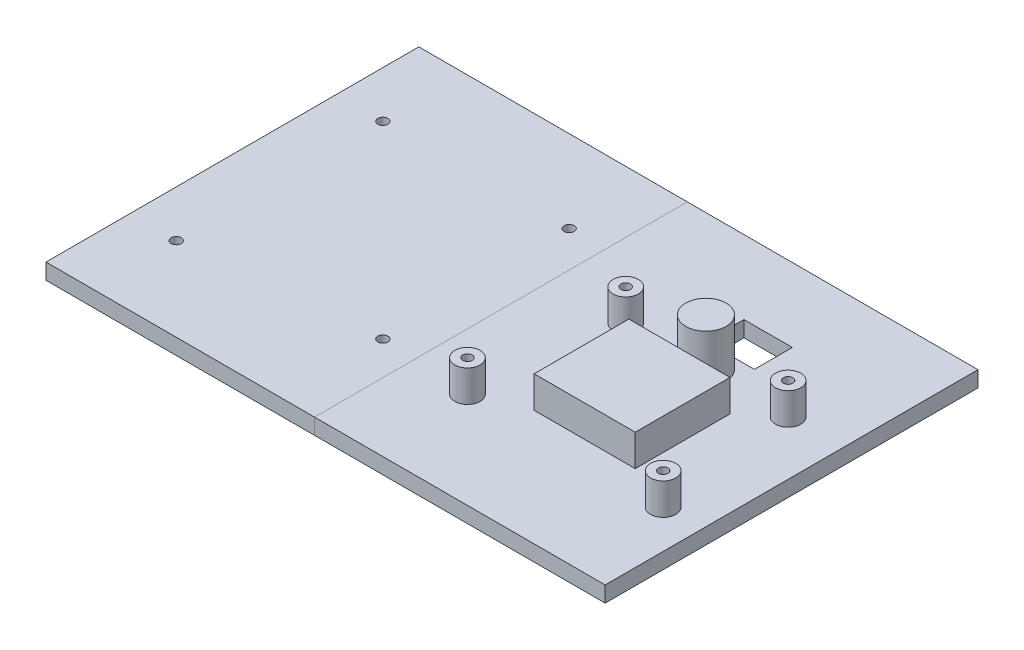
ISO-10303-21;
HEADER;
FILE_DESCRIPTION(('STEP AP214'),'2;1');
FILE_NAME('part.step','',(''),(''),'','','');
FILE_SCHEMA(('AUTOMOTIVE_DESIGN { 1 0 10303 214 1 1 1 1 }'));
ENDSEC;
DATA;
#1=APPLICATION_CONTEXT('core data for automotive mechanical design processes');
#2=APPLICATION_PROTOCOL_DEFINITION('international standard','automotive_design',2000,#1);
#3=PRODUCT_CONTEXT('',#1,'mechanical');
#4=PRODUCT('Part','Part','',(#3));
#5=PRODUCT_RELATED_PRODUCT_CATEGORY('part','',(#4));
#6=PRODUCT_DEFINITION_FORMATION('','',#4);
#7=PRODUCT_DEFINITION_CONTEXT('part definition',#1,'design');
#8=PRODUCT_DEFINITION('design','',#6,#7);
#9=PRODUCT_DEFINITION_SHAPE('','',#8);
#10=(LENGTH_UNIT() NAMED_UNIT(*) SI_UNIT(.MILLI.,.METRE.));
#11=(NAMED_UNIT(*) PLANE_ANGLE_UNIT() SI_UNIT($,.RADIAN.));
#12=(NAMED_UNIT(*) SI_UNIT($,.STERADIAN.) SOLID_ANGLE_UNIT());
#13=UNCERTAINTY_MEASURE_WITH_UNIT(LENGTH_MEASURE(1.E-05),#10,'distance_accuracy_value','');
#14=(GEOMETRIC_REPRESENTATION_CONTEXT(3) GLOBAL_UNCERTAINTY_ASSIGNED_CONTEXT((#13)) GLOBAL_UNIT_ASSIGNED_CONTEXT((#10,
#11,#12)) REPRESENTATION_CONTEXT('',''));
#15=CARTESIAN_POINT('',(0.,0.,0.));
#16=DIRECTION('',(0.,0.,1.));
#17=DIRECTION('',(1.,0.,0.));
#18=AXIS2_PLACEMENT_3D('',#15,#16,#17);
#19=CARTESIAN_POINT('',(-48.875,0.,0.));
#20=DIRECTION('',(1.,0.,0.));
#21=DIRECTION('',(0.,0.,-1.));
#22=AXIS2_PLACEMENT_3D('',#19,#20,#21);
#23=PLANE('',#22);
#24=DIRECTION('',(0.,-1.,0.));
#25=VECTOR('',#24,1.);
#26=CARTESIAN_POINT('',(-48.875,5.,-55.5));
#27=LINE('',#26,#25);
#28=CARTESIAN_POINT('',(-48.875,5.,-55.5));
#29=VERTEX_POINT('',#28);
#30=CARTESIAN_POINT('',(-48.875,0.,-55.5));
#31=VERTEX_POINT('',#30);
#32=EDGE_CURVE('E82',#29,#31,#27,.T.);
#33=ORIENTED_EDGE('',*,*,#32,.F.);
#34=DIRECTION('',(0.,0.,-1.));
#35=VECTOR('',#34,1.);
#36=CARTESIAN_POINT('',(-48.875,5.,0.));
#37=LINE('',#36,#35);
#38=CARTESIAN_POINT('',(-48.875,5.,62.5));
#39=VERTEX_POINT('',#38);
#40=EDGE_CURVE('E102',#39,#29,#37,.T.);
#41=ORIENTED_EDGE('',*,*,#40,.F.);
#42=DIRECTION('',(0.,-1.,0.));
#43=VECTOR('',#42,1.);
#44=CARTESIAN_POINT('',(-48.875,5.,62.5));
#45=LINE('',#44,#43);
#46=CARTESIAN_POINT('',(-48.875,0.,62.5));
#47=VERTEX_POINT('',#46);
#48=EDGE_CURVE('E94',#39,#47,#45,.T.);
#49=ORIENTED_EDGE('',*,*,#48,.T.);
#50=DIRECTION('',(0.,0.,-1.));
#51=VECTOR('',#50,1.);
#52=CARTESIAN_POINT('',(-48.875,0.,0.));
#53=LINE('',#52,#51);
#54=EDGE_CURVE('E99',#47,#31,#53,.T.);
#55=ORIENTED_EDGE('',*,*,#54,.T.);
#56=EDGE_LOOP('',(#33,#41,#49,#55));
#57=FACE_BOUND('',#56,.T.);
#58=ADVANCED_FACE('F45',(#57),#23,.T.);
#59=CARTESIAN_POINT('',(0.,5.,0.));
#60=DIRECTION('',(0.,1.,0.));
#61=DIRECTION('',(0.,0.,1.));
#62=AXIS2_PLACEMENT_3D('',#59,#60,#61);
#63=PLANE('',#62);
#64=CARTESIAN_POINT('',(-119.139988314674,5.,36.013));
#65=DIRECTION('',(0.,1.,0.));
#66=DIRECTION('',(0.,0.,1.));
#67=AXIS2_PLACEMENT_3D('',#64,#65,#66);
#68=CIRCLE('',#67,1.59999999999999);
#69=CARTESIAN_POINT('',(-119.139988314674,5.,37.613));
#70=VERTEX_POINT('',#69);
#71=EDGE_CURVE('E242',#70,#70,#68,.T.);
#72=ORIENTED_EDGE('',*,*,#71,.F.);
#73=EDGE_LOOP('',(#72));
#74=FACE_BOUND('',#73,.T.);
#75=CARTESIAN_POINT('',(-119.139988314674,5.,-29.392));
#76=DIRECTION('',(0.,1.,0.));
#77=DIRECTION('',(0.,0.,1.));
#78=AXIS2_PLACEMENT_3D('',#75,#76,#77);
#79=CIRCLE('',#78,1.6);
#80=CARTESIAN_POINT('',(-119.139988314674,5.,-27.792));
#81=VERTEX_POINT('',#80);
#82=EDGE_CURVE('E229',#81,#81,#79,.T.);
#83=ORIENTED_EDGE('',*,*,#82,.F.);
#84=EDGE_LOOP('',(#83));
#85=FACE_BOUND('',#84,.T.);
#86=CARTESIAN_POINT('',(-60.2619883146741,5.,-29.4860000000002));
#87=DIRECTION('',(0.,1.,0.));
#88=DIRECTION('',(0.,0.,1.));
#89=AXIS2_PLACEMENT_3D('',#86,#87,#88);
#90=CIRCLE('',#89,1.6);
#91=CARTESIAN_POINT('',(-60.2619883146741,5.,-27.8860000000002));
#92=VERTEX_POINT('',#91);
#93=EDGE_CURVE('E245',#92,#92,#90,.T.);
#94=ORIENTED_EDGE('',*,*,#93,.F.);
#95=EDGE_LOOP('',(#94));
#96=FACE_BOUND('',#95,.T.);
#97=CARTESIAN_POINT('',(-59.4499883146739,5.,30.2979999999998));
#98=DIRECTION('',(0.,1.,0.));
#99=DIRECTION('',(0.,0.,1.));
#100=AXIS2_PLACEMENT_3D('',#97,#98,#99);
#101=CIRCLE('',#100,1.6);
#102=CARTESIAN_POINT('',(-59.4499883146739,5.,31.8979999999998));
#103=VERTEX_POINT('',#102);
#104=EDGE_CURVE('E111',#103,#103,#101,.T.);
#105=ORIENTED_EDGE('',*,*,#104,.F.);
#106=EDGE_LOOP('',(#105));
#107=FACE_BOUND('',#106,.T.);
#108=DIRECTION('',(1.,0.,0.));
#109=VECTOR('',#108,1.);
#110=CARTESIAN_POINT('',(0.,5.,62.5));
#111=LINE('',#110,#109);
#112=CARTESIAN_POINT('',(-133.875,5.,62.5));
#113=VERTEX_POINT('',#112);
#114=EDGE_CURVE('E74',#113,#39,#111,.T.);
#115=ORIENTED_EDGE('',*,*,#114,.T.);
#116=ORIENTED_EDGE('',*,*,#40,.T.);
#117=DIRECTION('',(1.,0.,0.));
#118=VECTOR('',#117,1.);
#119=CARTESIAN_POINT('',(0.,5.,-55.5));
#120=LINE('',#119,#118);
#121=CARTESIAN_POINT('',(-133.875,5.,-55.5));
#122=VERTEX_POINT('',#121);
#123=EDGE_CURVE('E112',#122,#29,#120,.T.);
#124=ORIENTED_EDGE('',*,*,#123,.F.);
#125=DIRECTION('',(0.,0.,1.));
#126=VECTOR('',#125,1.);
#127=CARTESIAN_POINT('',(-133.875,5.,0.));
#128=LINE('',#127,#126);
#129=EDGE_CURVE('E110',#122,#113,#128,.T.);
#130=ORIENTED_EDGE('',*,*,#129,.T.);
#131=EDGE_LOOP('',(#115,#116,#124,#130));
#132=FACE_BOUND('',#131,.T.);
#133=ADVANCED_FACE('F123',(#74,#85,#96,#107,#132),#63,.T.);
#134=CARTESIAN_POINT('',(0.,0.,0.));
#135=DIRECTION('',(0.,1.,0.));
#136=DIRECTION('',(0.,0.,1.));
#137=AXIS2_PLACEMENT_3D('',#134,#135,#136);
#138=PLANE('',#137);
#139=CARTESIAN_POINT('',(-59.4499883146739,0.,30.2979999999998));
#140=DIRECTION('',(0.,1.,0.));
#141=DIRECTION('',(0.,0.,1.));
#142=AXIS2_PLACEMENT_3D('',#139,#140,#141);
#143=CIRCLE('',#142,1.6);
#144=CARTESIAN_POINT('',(-59.4499883146739,0.,31.8979999999998));
#145=VERTEX_POINT('',#144);
#146=EDGE_CURVE('E98',#145,#145,#143,.T.);
#147=ORIENTED_EDGE('',*,*,#146,.T.);
#148=EDGE_LOOP('',(#147));
#149=FACE_BOUND('',#148,.T.);
#150=CARTESIAN_POINT('',(-60.2619883146741,0.,-29.4860000000002));
#151=DIRECTION('',(0.,1.,0.));
#152=DIRECTION('',(0.,0.,1.));
#153=AXIS2_PLACEMENT_3D('',#150,#151,#152);
#154=CIRCLE('',#153,1.6);
#155=CARTESIAN_POINT('',(-60.2619883146741,0.,-27.8860000000002));
#156=VERTEX_POINT('',#155);
#157=EDGE_CURVE('E233',#156,#156,#154,.T.);
#158=ORIENTED_EDGE('',*,*,#157,.T.);
#159=EDGE_LOOP('',(#158));
#160=FACE_BOUND('',#159,.T.);
#161=CARTESIAN_POINT('',(-119.139988314674,0.,-29.392));
#162=DIRECTION('',(0.,1.,0.));
#163=DIRECTION('',(0.,0.,1.));
#164=AXIS2_PLACEMENT_3D('',#161,#162,#163);
#165=CIRCLE('',#164,1.6);
#166=CARTESIAN_POINT('',(-119.139988314674,0.,-27.792));
#167=VERTEX_POINT('',#166);
#168=EDGE_CURVE('E116',#167,#167,#165,.T.);
#169=ORIENTED_EDGE('',*,*,#168,.T.);
#170=EDGE_LOOP('',(#169));
#171=FACE_BOUND('',#170,.T.);
#172=CARTESIAN_POINT('',(-119.139988314674,0.,36.013));
#173=DIRECTION('',(0.,1.,0.));
#174=DIRECTION('',(0.,0.,1.));
#175=AXIS2_PLACEMENT_3D('',#172,#173,#174);
#176=CIRCLE('',#175,1.59999999999999);
#177=CARTESIAN_POINT('',(-119.139988314674,0.,37.613));
#178=VERTEX_POINT('',#177);
#179=EDGE_CURVE('E113',#178,#178,#176,.T.);
#180=ORIENTED_EDGE('',*,*,#179,.T.);
#181=EDGE_LOOP('',(#180));
#182=FACE_BOUND('',#181,.T.);
#183=ORIENTED_EDGE('',*,*,#54,.F.);
#184=DIRECTION('',(1.,0.,0.));
#185=VECTOR('',#184,1.);
#186=CARTESIAN_POINT('',(0.,0.,62.5));
#187=LINE('',#186,#185);
#188=CARTESIAN_POINT('',(-133.875,0.,62.5));
#189=VERTEX_POINT('',#188);
#190=EDGE_CURVE('E90',#189,#47,#187,.T.);
#191=ORIENTED_EDGE('',*,*,#190,.F.);
#192=DIRECTION('',(0.,0.,1.));
#193=VECTOR('',#192,1.);
#194=CARTESIAN_POINT('',(-133.875,0.,0.));
#195=LINE('',#194,#193);
#196=CARTESIAN_POINT('',(-133.875,0.,-55.5));
#197=VERTEX_POINT('',#196);
#198=EDGE_CURVE('E54',#197,#189,#195,.T.);
#199=ORIENTED_EDGE('',*,*,#198,.F.);
#200=DIRECTION('',(1.,0.,0.));
#201=VECTOR('',#200,1.);
#202=CARTESIAN_POINT('',(0.,0.,-55.5));
#203=LINE('',#202,#201);
#204=EDGE_CURVE('E12',#197,#31,#203,.T.);
#205=ORIENTED_EDGE('',*,*,#204,.T.);
#206=EDGE_LOOP('',(#183,#191,#199,#205));
#207=FACE_BOUND('',#206,.T.);
#208=ADVANCED_FACE('F100',(#149,#160,#171,#182,#207),#138,.F.);
#209=CARTESIAN_POINT('',(0.,5.,-55.5));
#210=DIRECTION('',(0.,0.,-1.));
#211=DIRECTION('',(-1.,0.,0.));
#212=AXIS2_PLACEMENT_3D('',#209,#210,#211);
#213=PLANE('',#212);
#214=ORIENTED_EDGE('',*,*,#123,.T.);
#215=ORIENTED_EDGE('',*,*,#32,.T.);
#216=ORIENTED_EDGE('',*,*,#204,.F.);
#217=DIRECTION('',(0.,-1.,0.));
#218=VECTOR('',#217,1.);
#219=CARTESIAN_POINT('',(-133.875,5.,-55.5));
#220=LINE('',#219,#218);
#221=EDGE_CURVE('E62',#122,#197,#220,.T.);
#222=ORIENTED_EDGE('',*,*,#221,.F.);
#223=EDGE_LOOP('',(#214,#215,#216,#222));
#224=FACE_BOUND('',#223,.T.);
#225=ADVANCED_FACE('F47',(#224),#213,.T.);
#226=CARTESIAN_POINT('',(0.,5.,62.5));
#227=DIRECTION('',(0.,0.,-1.));
#228=DIRECTION('',(-1.,0.,0.));
#229=AXIS2_PLACEMENT_3D('',#226,#227,#228);
#230=PLANE('',#229);
#231=ORIENTED_EDGE('',*,*,#48,.F.);
#232=ORIENTED_EDGE('',*,*,#114,.F.);
#233=DIRECTION('',(0.,-1.,0.));
#234=VECTOR('',#233,1.);
#235=CARTESIAN_POINT('',(-133.875,5.,62.5));
#236=LINE('',#235,#234);
#237=EDGE_CURVE('E96',#113,#189,#236,.T.);
#238=ORIENTED_EDGE('',*,*,#237,.T.);
#239=ORIENTED_EDGE('',*,*,#190,.T.);
#240=EDGE_LOOP('',(#231,#232,#238,#239));
#241=FACE_BOUND('',#240,.T.);
#242=ADVANCED_FACE('F92',(#241),#230,.F.);
#243=CARTESIAN_POINT('',(-133.875,5.,0.));
#244=DIRECTION('',(1.,0.,0.));
#245=DIRECTION('',(0.,0.,-1.));
#246=AXIS2_PLACEMENT_3D('',#243,#244,#245);
#247=PLANE('',#246);
#248=ORIENTED_EDGE('',*,*,#198,.T.);
#249=ORIENTED_EDGE('',*,*,#237,.F.);
#250=ORIENTED_EDGE('',*,*,#129,.F.);
#251=ORIENTED_EDGE('',*,*,#221,.T.);
#252=EDGE_LOOP('',(#248,#249,#250,#251));
#253=FACE_BOUND('',#252,.T.);
#254=ADVANCED_FACE('F138',(#253),#247,.F.);
#255=CARTESIAN_POINT('',(-119.139988314674,5.,-29.392));
#256=DIRECTION('',(0.,-1.,0.));
#257=DIRECTION('',(0.,0.,-1.));
#258=AXIS2_PLACEMENT_3D('',#255,#256,#257);
#259=CYLINDRICAL_SURFACE('',#258,1.6);
#260=ORIENTED_EDGE('',*,*,#82,.T.);
#261=EDGE_LOOP('',(#260));
#262=FACE_BOUND('',#261,.T.);
#263=ORIENTED_EDGE('',*,*,#168,.F.);
#264=EDGE_LOOP('',(#263));
#265=FACE_BOUND('',#264,.T.);
#266=ADVANCED_FACE('F143',(#262,#265),#259,.F.);
#267=CARTESIAN_POINT('',(-60.2619883146741,5.,-29.4860000000002));
#268=DIRECTION('',(0.,-1.,0.));
#269=DIRECTION('',(0.,0.,-1.));
#270=AXIS2_PLACEMENT_3D('',#267,#268,#269);
#271=CYLINDRICAL_SURFACE('',#270,1.6);
#272=ORIENTED_EDGE('',*,*,#93,.T.);
#273=EDGE_LOOP('',(#272));
#274=FACE_BOUND('',#273,.T.);
#275=ORIENTED_EDGE('',*,*,#157,.F.);
#276=EDGE_LOOP('',(#275));
#277=FACE_BOUND('',#276,.T.);
#278=ADVANCED_FACE('F183',(#274,#277),#271,.F.);
#279=CARTESIAN_POINT('',(-59.4499883146739,5.,30.2979999999998));
#280=DIRECTION('',(0.,-1.,0.));
#281=DIRECTION('',(0.,0.,-1.));
#282=AXIS2_PLACEMENT_3D('',#279,#280,#281);
#283=CYLINDRICAL_SURFACE('',#282,1.6);
#284=ORIENTED_EDGE('',*,*,#104,.T.);
#285=EDGE_LOOP('',(#284));
#286=FACE_BOUND('',#285,.T.);
#287=ORIENTED_EDGE('',*,*,#146,.F.);
#288=EDGE_LOOP('',(#287));
#289=FACE_BOUND('',#288,.T.);
#290=ADVANCED_FACE('F174',(#286,#289),#283,.F.);
#291=CARTESIAN_POINT('',(-119.139988314674,5.,36.013));
#292=DIRECTION('',(0.,-1.,0.));
#293=DIRECTION('',(0.,0.,-1.));
#294=AXIS2_PLACEMENT_3D('',#291,#292,#293);
#295=CYLINDRICAL_SURFACE('',#294,1.59999999999999);
#296=ORIENTED_EDGE('',*,*,#71,.T.);
#297=EDGE_LOOP('',(#296));
#298=FACE_BOUND('',#297,.T.);
#299=ORIENTED_EDGE('',*,*,#179,.F.);
#300=EDGE_LOOP('',(#299));
#301=FACE_BOUND('',#300,.T.);
#302=ADVANCED_FACE('F134',(#298,#301),#295,.F.);
#303=CLOSED_SHELL('',(#58,#133,#208,#225,#242,#254,#266,#278,#290,#302));
#304=MANIFOLD_SOLID_BREP('B2',#303);
#305=CARTESIAN_POINT('',(-48.875,0.,0.));
#306=DIRECTION('',(1.,0.,0.));
#307=DIRECTION('',(0.,0.,-1.));
#308=AXIS2_PLACEMENT_3D('',#305,#306,#307);
#309=PLANE('',#308);
#310=DIRECTION('',(0.,-1.,0.));
#311=VECTOR('',#310,1.);
#312=CARTESIAN_POINT('',(-48.875,5.,-55.5));
#313=LINE('',#312,#311);
#314=CARTESIAN_POINT('',(-48.875,5.,-55.5));
#315=VERTEX_POINT('',#314);
#316=CARTESIAN_POINT('',(-48.875,0.,-55.5));
#317=VERTEX_POINT('',#316);
#318=EDGE_CURVE('E43',#315,#317,#313,.T.);
#319=ORIENTED_EDGE('',*,*,#318,.T.);
#320=DIRECTION('',(0.,0.,-1.));
#321=VECTOR('',#320,1.);
#322=CARTESIAN_POINT('',(-48.875,0.,0.));
#323=LINE('',#322,#321);
#324=CARTESIAN_POINT('',(-48.875,0.,62.5));
#325=VERTEX_POINT('',#324);
#326=EDGE_CURVE('E282',#325,#317,#323,.T.);
#327=ORIENTED_EDGE('',*,*,#326,.F.);
#328=DIRECTION('',(0.,-1.,0.));
#329=VECTOR('',#328,1.);
#330=CARTESIAN_POINT('',(-48.875,5.,62.5));
#331=LINE('',#330,#329);
#332=CARTESIAN_POINT('',(-48.875,5.,62.5));
#333=VERTEX_POINT('',#332);
#334=EDGE_CURVE('E452',#333,#325,#331,.T.);
#335=ORIENTED_EDGE('',*,*,#334,.F.);
#336=DIRECTION('',(0.,0.,-1.));
#337=VECTOR('',#336,1.);
#338=CARTESIAN_POINT('',(-48.875,5.,0.));
#339=LINE('',#338,#337);
#340=EDGE_CURVE('E275',#333,#315,#339,.T.);
#341=ORIENTED_EDGE('',*,*,#340,.T.);
#342=EDGE_LOOP('',(#319,#327,#335,#341));
#343=FACE_BOUND('',#342,.T.);
#344=ADVANCED_FACE('F268',(#343),#309,.F.);
#345=CARTESIAN_POINT('',(0.,20.,-12.51));
#346=DIRECTION('',(0.,1.,0.));
#347=DIRECTION('',(0.,0.,1.));
#348=AXIS2_PLACEMENT_3D('',#345,#346,#347);
#349=PLANE('',#348);
#350=CARTESIAN_POINT('',(0.,20.,-12.51));
#351=DIRECTION('',(0.,1.,0.));
#352=DIRECTION('',(0.,0.,1.));
#353=AXIS2_PLACEMENT_3D('',#350,#351,#352);
#354=CIRCLE('',#353,6.39);
#355=CARTESIAN_POINT('',(0.,20.,-6.12000000000001));
#356=VERTEX_POINT('',#355);
#357=EDGE_CURVE('E563',#356,#356,#354,.T.);
#358=ORIENTED_EDGE('',*,*,#357,.T.);
#359=EDGE_LOOP('',(#358));
#360=FACE_BOUND('',#359,.T.);
#361=ADVANCED_FACE('F480',(#360),#349,.T.);
#362=CARTESIAN_POINT('',(0.,15.,0.));
#363=DIRECTION('',(0.,1.,0.));
#364=DIRECTION('',(0.,0.,1.));
#365=AXIS2_PLACEMENT_3D('',#362,#363,#364);
#366=PLANE('',#365);
#367=DIRECTION('',(1.,0.,0.));
#368=VECTOR('',#367,1.);
#369=CARTESIAN_POINT('',(0.,15.,25.88));
#370=LINE('',#369,#368);
#371=CARTESIAN_POINT('',(-16.,15.,25.88));
#372=VERTEX_POINT('',#371);
#373=CARTESIAN_POINT('',(16.,15.,25.88));
#374=VERTEX_POINT('',#373);
#375=EDGE_CURVE('E368',#372,#374,#370,.T.);
#376=ORIENTED_EDGE('',*,*,#375,.T.);
#377=DIRECTION('',(0.,0.,-1.));
#378=VECTOR('',#377,1.);
#379=CARTESIAN_POINT('',(16.,15.,0.));
#380=LINE('',#379,#378);
#381=CARTESIAN_POINT('',(16.,15.,-4.12000000000001));
#382=VERTEX_POINT('',#381);
#383=EDGE_CURVE('E355',#374,#382,#380,.T.);
#384=ORIENTED_EDGE('',*,*,#383,.T.);
#385=DIRECTION('',(1.,0.,0.));
#386=VECTOR('',#385,1.);
#387=CARTESIAN_POINT('',(0.,15.,-4.12000000000001));
#388=LINE('',#387,#386);
#389=CARTESIAN_POINT('',(-16.,15.,-4.12000000000001));
#390=VERTEX_POINT('',#389);
#391=EDGE_CURVE('E367',#390,#382,#388,.T.);
#392=ORIENTED_EDGE('',*,*,#391,.F.);
#393=DIRECTION('',(0.,0.,-1.));
#394=VECTOR('',#393,1.);
#395=CARTESIAN_POINT('',(-16.,15.,0.));
#396=LINE('',#395,#394);
#397=EDGE_CURVE('E374',#372,#390,#396,.T.);
#398=ORIENTED_EDGE('',*,*,#397,.F.);
#399=EDGE_LOOP('',(#376,#384,#392,#398));
#400=FACE_BOUND('',#399,.T.);
#401=ADVANCED_FACE('F372',(#400),#366,.T.);
#402=CARTESIAN_POINT('',(0.,15.,0.));
#403=DIRECTION('',(0.,1.,0.));
#404=DIRECTION('',(0.,0.,1.));
#405=AXIS2_PLACEMENT_3D('',#402,#403,#404);
#406=PLANE('',#405);
#407=CARTESIAN_POINT('',(30.975,15.,32.));
#408=DIRECTION('',(0.,1.,0.));
#409=DIRECTION('',(0.,0.,1.));
#410=AXIS2_PLACEMENT_3D('',#407,#408,#409);
#411=CIRCLE('',#410,1.50000000000001);
#412=CARTESIAN_POINT('',(30.975,15.,33.5));
#413=VERTEX_POINT('',#412);
#414=EDGE_CURVE('E611',#413,#413,#411,.F.);
#415=ORIENTED_EDGE('',*,*,#414,.T.);
#416=EDGE_LOOP('',(#415));
#417=FACE_BOUND('',#416,.T.);
#418=CARTESIAN_POINT('',(30.975,15.,32.));
#419=DIRECTION('',(0.,1.,0.));
#420=DIRECTION('',(0.,0.,1.));
#421=AXIS2_PLACEMENT_3D('',#418,#419,#420);
#422=CIRCLE('',#421,4.);
#423=CARTESIAN_POINT('',(30.975,15.,36.));
#424=VERTEX_POINT('',#423);
#425=EDGE_CURVE('E614',#424,#424,#422,.T.);
#426=ORIENTED_EDGE('',*,*,#425,.T.);
#427=EDGE_LOOP('',(#426));
#428=FACE_BOUND('',#427,.T.);
#429=ADVANCED_FACE('F489',(#417,#428),#406,.T.);
#430=CARTESIAN_POINT('',(0.,15.,0.));
#431=DIRECTION('',(0.,1.,0.));
#432=DIRECTION('',(0.,0.,1.));
#433=AXIS2_PLACEMENT_3D('',#430,#431,#432);
#434=PLANE('',#433);
#435=CARTESIAN_POINT('',(-25.375,15.,-12.5));
#436=DIRECTION('',(0.,1.,0.));
#437=DIRECTION('',(0.,0.,1.));
#438=AXIS2_PLACEMENT_3D('',#435,#436,#437);
#439=CIRCLE('',#438,1.5);
#440=CARTESIAN_POINT('',(-25.375,15.,-11.));
#441=VERTEX_POINT('',#440);
#442=EDGE_CURVE('E557',#441,#441,#439,.F.);
#443=ORIENTED_EDGE('',*,*,#442,.T.);
#444=EDGE_LOOP('',(#443));
#445=FACE_BOUND('',#444,.T.);
#446=CARTESIAN_POINT('',(-25.375,15.,-12.5));
#447=DIRECTION('',(0.,1.,0.));
#448=DIRECTION('',(0.,0.,1.));
#449=AXIS2_PLACEMENT_3D('',#446,#447,#448);
#450=CIRCLE('',#449,4.);
#451=CARTESIAN_POINT('',(-25.375,15.,-8.5));
#452=VERTEX_POINT('',#451);
#453=EDGE_CURVE('E559',#452,#452,#450,.T.);
#454=ORIENTED_EDGE('',*,*,#453,.T.);
#455=EDGE_LOOP('',(#454));
#456=FACE_BOUND('',#455,.T.);
#457=ADVANCED_FACE('F639',(#445,#456),#434,.T.);
#458=CARTESIAN_POINT('',(0.,15.,0.));
#459=DIRECTION('',(0.,1.,0.));
#460=DIRECTION('',(0.,0.,1.));
#461=AXIS2_PLACEMENT_3D('',#458,#459,#460);
#462=PLANE('',#461);
#463=CARTESIAN_POINT('',(26.025,15.,-12.5));
#464=DIRECTION('',(0.,1.,0.));
#465=DIRECTION('',(0.,0.,1.));
#466=AXIS2_PLACEMENT_3D('',#463,#464,#465);
#467=CIRCLE('',#466,1.5);
#468=CARTESIAN_POINT('',(26.025,15.,-11.));
#469=VERTEX_POINT('',#468);
#470=EDGE_CURVE('E618',#469,#469,#467,.F.);
#471=ORIENTED_EDGE('',*,*,#470,.T.);
#472=EDGE_LOOP('',(#471));
#473=FACE_BOUND('',#472,.T.);
#474=CARTESIAN_POINT('',(26.025,15.,-12.5));
#475=DIRECTION('',(0.,1.,0.));
#476=DIRECTION('',(0.,0.,1.));
#477=AXIS2_PLACEMENT_3D('',#474,#475,#476);
#478=CIRCLE('',#477,4.);
#479=CARTESIAN_POINT('',(26.025,15.,-8.5));
#480=VERTEX_POINT('',#479);
#481=EDGE_CURVE('E566',#480,#480,#478,.T.);
#482=ORIENTED_EDGE('',*,*,#481,.T.);
#483=EDGE_LOOP('',(#482));
#484=FACE_BOUND('',#483,.T.);
#485=ADVANCED_FACE('F623',(#473,#484),#462,.T.);
#486=CARTESIAN_POINT('',(0.,15.,0.));
#487=DIRECTION('',(0.,1.,0.));
#488=DIRECTION('',(0.,0.,1.));
#489=AXIS2_PLACEMENT_3D('',#486,#487,#488);
#490=PLANE('',#489);
#491=CARTESIAN_POINT('',(-30.975,15.,32.));
#492=DIRECTION('',(0.,1.,0.));
#493=DIRECTION('',(0.,0.,1.));
#494=AXIS2_PLACEMENT_3D('',#491,#492,#493);
#495=CIRCLE('',#494,1.5);
#496=CARTESIAN_POINT('',(-30.975,15.,33.5));
#497=VERTEX_POINT('',#496);
#498=EDGE_CURVE('E604',#497,#497,#495,.F.);
#499=ORIENTED_EDGE('',*,*,#498,.T.);
#500=EDGE_LOOP('',(#499));
#501=FACE_BOUND('',#500,.T.);
#502=CARTESIAN_POINT('',(-30.975,15.,32.));
#503=DIRECTION('',(0.,1.,0.));
#504=DIRECTION('',(0.,0.,1.));
#505=AXIS2_PLACEMENT_3D('',#502,#503,#504);
#506=CIRCLE('',#505,4.);
#507=CARTESIAN_POINT('',(-30.975,15.,36.));
#508=VERTEX_POINT('',#507);
#509=EDGE_CURVE('E607',#508,#508,#506,.T.);
#510=ORIENTED_EDGE('',*,*,#509,.T.);
#511=EDGE_LOOP('',(#510));
#512=FACE_BOUND('',#511,.T.);
#513=ADVANCED_FACE('F645',(#501,#512),#490,.T.);
#514=CARTESIAN_POINT('',(-30.975,15.,32.));
#515=DIRECTION('',(0.,-1.,0.));
#516=DIRECTION('',(0.,0.,-1.));
#517=AXIS2_PLACEMENT_3D('',#514,#515,#516);
#518=CYLINDRICAL_SURFACE('',#517,4.);
#519=ORIENTED_EDGE('',*,*,#509,.F.);
#520=EDGE_LOOP('',(#519));
#521=FACE_BOUND('',#520,.T.);
#522=CARTESIAN_POINT('',(-30.975,5.,32.));
#523=DIRECTION('',(0.,1.,0.));
#524=DIRECTION('',(0.,0.,1.));
#525=AXIS2_PLACEMENT_3D('',#522,#523,#524);
#526=CIRCLE('',#525,4.);
#527=CARTESIAN_POINT('',(-30.975,5.,36.));
#528=VERTEX_POINT('',#527);
#529=EDGE_CURVE('E602',#528,#528,#526,.T.);
#530=ORIENTED_EDGE('',*,*,#529,.T.);
#531=EDGE_LOOP('',(#530));
#532=FACE_BOUND('',#531,.T.);
#533=ADVANCED_FACE('F635',(#521,#532),#518,.T.);
#534=CARTESIAN_POINT('',(30.975,15.,32.));
#535=DIRECTION('',(0.,-1.,0.));
#536=DIRECTION('',(0.,0.,-1.));
#537=AXIS2_PLACEMENT_3D('',#534,#535,#536);
#538=CYLINDRICAL_SURFACE('',#537,4.);
#539=ORIENTED_EDGE('',*,*,#425,.F.);
#540=EDGE_LOOP('',(#539));
#541=FACE_BOUND('',#540,.T.);
#542=CARTESIAN_POINT('',(30.975,5.,32.));
#543=DIRECTION('',(0.,1.,0.));
#544=DIRECTION('',(0.,0.,1.));
#545=AXIS2_PLACEMENT_3D('',#542,#543,#544);
#546=CIRCLE('',#545,4.);
#547=CARTESIAN_POINT('',(30.975,5.,36.));
#548=VERTEX_POINT('',#547);
#549=EDGE_CURVE('E599',#548,#548,#546,.T.);
#550=ORIENTED_EDGE('',*,*,#549,.T.);
#551=EDGE_LOOP('',(#550));
#552=FACE_BOUND('',#551,.T.);
#553=ADVANCED_FACE('F628',(#541,#552),#538,.T.);
#554=CARTESIAN_POINT('',(26.025,15.,-12.5));
#555=DIRECTION('',(0.,-1.,0.));
#556=DIRECTION('',(0.,0.,-1.));
#557=AXIS2_PLACEMENT_3D('',#554,#555,#556);
#558=CYLINDRICAL_SURFACE('',#557,4.);
#559=ORIENTED_EDGE('',*,*,#481,.F.);
#560=EDGE_LOOP('',(#559));
#561=FACE_BOUND('',#560,.T.);
#562=CARTESIAN_POINT('',(26.025,5.,-12.5));
#563=DIRECTION('',(0.,1.,0.));
#564=DIRECTION('',(0.,0.,1.));
#565=AXIS2_PLACEMENT_3D('',#562,#563,#564);
#566=CIRCLE('',#565,4.);
#567=CARTESIAN_POINT('',(26.025,5.,-8.5));
#568=VERTEX_POINT('',#567);
#569=EDGE_CURVE('E569',#568,#568,#566,.T.);
#570=ORIENTED_EDGE('',*,*,#569,.T.);
#571=EDGE_LOOP('',(#570));
#572=FACE_BOUND('',#571,.T.);
#573=ADVANCED_FACE('F625',(#561,#572),#558,.T.);
#574=CARTESIAN_POINT('',(-25.375,15.,-12.5));
#575=DIRECTION('',(0.,-1.,0.));
#576=DIRECTION('',(0.,0.,-1.));
#577=AXIS2_PLACEMENT_3D('',#574,#575,#576);
#578=CYLINDRICAL_SURFACE('',#577,4.);
#579=ORIENTED_EDGE('',*,*,#453,.F.);
#580=EDGE_LOOP('',(#579));
#581=FACE_BOUND('',#580,.T.);
#582=CARTESIAN_POINT('',(-25.375,5.,-12.5));
#583=DIRECTION('',(0.,1.,0.));
#584=DIRECTION('',(0.,0.,1.));
#585=AXIS2_PLACEMENT_3D('',#582,#583,#584);
#586=CIRCLE('',#585,4.);
#587=CARTESIAN_POINT('',(-25.375,5.,-8.5));
#588=VERTEX_POINT('',#587);
#589=EDGE_CURVE('E560',#588,#588,#586,.T.);
#590=ORIENTED_EDGE('',*,*,#589,.T.);
#591=EDGE_LOOP('',(#590));
#592=FACE_BOUND('',#591,.T.);
#593=ADVANCED_FACE('F494',(#581,#592),#578,.T.);
#594=CARTESIAN_POINT('',(0.,0.,-12.51));
#595=DIRECTION('',(0.,1.,0.));
#596=DIRECTION('',(0.,0.,1.));
#597=AXIS2_PLACEMENT_3D('',#594,#595,#596);
#598=CYLINDRICAL_SURFACE('',#597,6.39);
#599=CARTESIAN_POINT('',(0.,5.,-12.51));
#600=DIRECTION('',(0.,1.,0.));
#601=DIRECTION('',(0.,0.,1.));
#602=AXIS2_PLACEMENT_3D('',#599,#600,#601);
#603=CIRCLE('',#602,6.39);
#604=CARTESIAN_POINT('',(0.,5.,-6.12000000000001));
#605=VERTEX_POINT('',#604);
#606=EDGE_CURVE('E408',#605,#605,#603,.T.);
#607=ORIENTED_EDGE('',*,*,#606,.T.);
#608=EDGE_LOOP('',(#607));
#609=FACE_BOUND('',#608,.T.);
#610=ORIENTED_EDGE('',*,*,#357,.F.);
#611=EDGE_LOOP('',(#610));
#612=FACE_BOUND('',#611,.T.);
#613=ADVANCED_FACE('F496',(#609,#612),#598,.T.);
#614=CARTESIAN_POINT('',(0.,15.,-4.12000000000001));
#615=DIRECTION('',(0.,0.,-1.));
#616=DIRECTION('',(-1.,0.,0.));
#617=AXIS2_PLACEMENT_3D('',#614,#615,#616);
#618=PLANE('',#617);
#619=DIRECTION('',(1.,0.,0.));
#620=VECTOR('',#619,1.);
#621=CARTESIAN_POINT('',(0.,5.,-4.12000000000001));
#622=LINE('',#621,#620);
#623=CARTESIAN_POINT('',(-16.,5.,-4.12000000000001));
#624=VERTEX_POINT('',#623);
#625=CARTESIAN_POINT('',(16.,5.,-4.12000000000001));
#626=VERTEX_POINT('',#625);
#627=EDGE_CURVE('E579',#624,#626,#622,.T.);
#628=ORIENTED_EDGE('',*,*,#627,.F.);
#629=DIRECTION('',(0.,-1.,0.));
#630=VECTOR('',#629,1.);
#631=CARTESIAN_POINT('',(-16.,15.,-4.12000000000001));
#632=LINE('',#631,#630);
#633=EDGE_CURVE('E386',#390,#624,#632,.T.);
#634=ORIENTED_EDGE('',*,*,#633,.F.);
#635=ORIENTED_EDGE('',*,*,#391,.T.);
#636=DIRECTION('',(0.,-1.,0.));
#637=VECTOR('',#636,1.);
#638=CARTESIAN_POINT('',(16.,15.,-4.12000000000001));
#639=LINE('',#638,#637);
#640=EDGE_CURVE('E363',#382,#626,#639,.T.);
#641=ORIENTED_EDGE('',*,*,#640,.T.);
#642=EDGE_LOOP('',(#628,#634,#635,#641));
#643=FACE_BOUND('',#642,.T.);
#644=ADVANCED_FACE('F498',(#643),#618,.T.);
#645=CARTESIAN_POINT('',(-16.,15.,0.));
#646=DIRECTION('',(-1.,0.,0.));
#647=DIRECTION('',(0.,0.,1.));
#648=AXIS2_PLACEMENT_3D('',#645,#646,#647);
#649=PLANE('',#648);
#650=DIRECTION('',(0.,0.,-1.));
#651=VECTOR('',#650,1.);
#652=CARTESIAN_POINT('',(-16.,5.,0.));
#653=LINE('',#652,#651);
#654=CARTESIAN_POINT('',(-16.,5.,25.88));
#655=VERTEX_POINT('',#654);
#656=EDGE_CURVE('E377',#655,#624,#653,.T.);
#657=ORIENTED_EDGE('',*,*,#656,.F.);
#658=DIRECTION('',(0.,-1.,0.));
#659=VECTOR('',#658,1.);
#660=CARTESIAN_POINT('',(-16.,15.,25.88));
#661=LINE('',#660,#659);
#662=EDGE_CURVE('E575',#372,#655,#661,.T.);
#663=ORIENTED_EDGE('',*,*,#662,.F.);
#664=ORIENTED_EDGE('',*,*,#397,.T.);
#665=ORIENTED_EDGE('',*,*,#633,.T.);
#666=EDGE_LOOP('',(#657,#663,#664,#665));
#667=FACE_BOUND('',#666,.T.);
#668=ADVANCED_FACE('F501',(#667),#649,.T.);
#669=CARTESIAN_POINT('',(0.,15.,25.88));
#670=DIRECTION('',(0.,0.,-1.));
#671=DIRECTION('',(-1.,0.,0.));
#672=AXIS2_PLACEMENT_3D('',#669,#670,#671);
#673=PLANE('',#672);
#674=DIRECTION('',(1.,0.,0.));
#675=VECTOR('',#674,1.);
#676=CARTESIAN_POINT('',(0.,5.,25.88));
#677=LINE('',#676,#675);
#678=CARTESIAN_POINT('',(16.,5.,25.88));
#679=VERTEX_POINT('',#678);
#680=EDGE_CURVE('E380',#655,#679,#677,.T.);
#681=ORIENTED_EDGE('',*,*,#680,.T.);
#682=DIRECTION('',(0.,-1.,0.));
#683=VECTOR('',#682,1.);
#684=CARTESIAN_POINT('',(16.,15.,25.88));
#685=LINE('',#684,#683);
#686=EDGE_CURVE('E360',#374,#679,#685,.T.);
#687=ORIENTED_EDGE('',*,*,#686,.F.);
#688=ORIENTED_EDGE('',*,*,#375,.F.);
#689=ORIENTED_EDGE('',*,*,#662,.T.);
#690=EDGE_LOOP('',(#681,#687,#688,#689));
#691=FACE_BOUND('',#690,.T.);
#692=ADVANCED_FACE('F379',(#691),#673,.F.);
#693=CARTESIAN_POINT('',(16.,15.,0.));
#694=DIRECTION('',(-1.,0.,0.));
#695=DIRECTION('',(0.,0.,1.));
#696=AXIS2_PLACEMENT_3D('',#693,#694,#695);
#697=PLANE('',#696);
#698=DIRECTION('',(0.,0.,-1.));
#699=VECTOR('',#698,1.);
#700=CARTESIAN_POINT('',(16.,5.,0.));
#701=LINE('',#700,#699);
#702=EDGE_CURVE('E577',#679,#626,#701,.T.);
#703=ORIENTED_EDGE('',*,*,#702,.T.);
#704=ORIENTED_EDGE('',*,*,#640,.F.);
#705=ORIENTED_EDGE('',*,*,#383,.F.);
#706=ORIENTED_EDGE('',*,*,#686,.T.);
#707=EDGE_LOOP('',(#703,#704,#705,#706));
#708=FACE_BOUND('',#707,.T.);
#709=ADVANCED_FACE('F358',(#708),#697,.F.);
#710=CARTESIAN_POINT('',(30.975,5.,32.));
#711=DIRECTION('',(0.,-1.,0.));
#712=DIRECTION('',(0.,0.,-1.));
#713=AXIS2_PLACEMENT_3D('',#710,#711,#712);
#714=CYLINDRICAL_SURFACE('',#713,1.50000000000001);
#715=CARTESIAN_POINT('',(30.975,0.,32.));
#716=DIRECTION('',(0.,1.,0.));
#717=DIRECTION('',(0.,0.,1.));
#718=AXIS2_PLACEMENT_3D('',#715,#716,#717);
#719=CIRCLE('',#718,1.50000000000001);
#720=CARTESIAN_POINT('',(30.975,0.,33.5));
#721=VERTEX_POINT('',#720);
#722=EDGE_CURVE('E425',#721,#721,#719,.T.);
#723=ORIENTED_EDGE('',*,*,#722,.F.);
#724=EDGE_LOOP('',(#723));
#725=FACE_BOUND('',#724,.T.);
#726=ORIENTED_EDGE('',*,*,#414,.F.);
#727=EDGE_LOOP('',(#726));
#728=FACE_BOUND('',#727,.T.);
#729=ADVANCED_FACE('F510',(#725,#728),#714,.F.);
#730=CARTESIAN_POINT('',(-25.375,5.,-12.5));
#731=DIRECTION('',(0.,-1.,0.));
#732=DIRECTION('',(0.,0.,-1.));
#733=AXIS2_PLACEMENT_3D('',#730,#731,#732);
#734=CYLINDRICAL_SURFACE('',#733,1.5);
#735=CARTESIAN_POINT('',(-25.375,0.,-12.5));
#736=DIRECTION('',(0.,1.,0.));
#737=DIRECTION('',(0.,0.,1.));
#738=AXIS2_PLACEMENT_3D('',#735,#736,#737);
#739=CIRCLE('',#738,1.5);
#740=CARTESIAN_POINT('',(-25.375,0.,-11.));
#741=VERTEX_POINT('',#740);
#742=EDGE_CURVE('E401',#741,#741,#739,.T.);
#743=ORIENTED_EDGE('',*,*,#742,.F.);
#744=EDGE_LOOP('',(#743));
#745=FACE_BOUND('',#744,.T.);
#746=ORIENTED_EDGE('',*,*,#442,.F.);
#747=EDGE_LOOP('',(#746));
#748=FACE_BOUND('',#747,.T.);
#749=ADVANCED_FACE('F545',(#745,#748),#734,.F.);
#750=CARTESIAN_POINT('',(26.025,5.,-12.5));
#751=DIRECTION('',(0.,-1.,0.));
#752=DIRECTION('',(0.,0.,-1.));
#753=AXIS2_PLACEMENT_3D('',#750,#751,#752);
#754=CYLINDRICAL_SURFACE('',#753,1.5);
#755=CARTESIAN_POINT('',(26.025,0.,-12.5));
#756=DIRECTION('',(0.,1.,0.));
#757=DIRECTION('',(0.,0.,1.));
#758=AXIS2_PLACEMENT_3D('',#755,#756,#757);
#759=CIRCLE('',#758,1.5);
#760=CARTESIAN_POINT('',(26.025,0.,-11.));
#761=VERTEX_POINT('',#760);
#762=EDGE_CURVE('E422',#761,#761,#759,.T.);
#763=ORIENTED_EDGE('',*,*,#762,.F.);
#764=EDGE_LOOP('',(#763));
#765=FACE_BOUND('',#764,.T.);
#766=ORIENTED_EDGE('',*,*,#470,.F.);
#767=EDGE_LOOP('',(#766));
#768=FACE_BOUND('',#767,.T.);
#769=ADVANCED_FACE('F541',(#765,#768),#754,.F.);
#770=CARTESIAN_POINT('',(-30.975,5.,32.));
#771=DIRECTION('',(0.,-1.,0.));
#772=DIRECTION('',(0.,0.,-1.));
#773=AXIS2_PLACEMENT_3D('',#770,#771,#772);
#774=CYLINDRICAL_SURFACE('',#773,1.5);
#775=CARTESIAN_POINT('',(-30.975,0.,32.));
#776=DIRECTION('',(0.,1.,0.));
#777=DIRECTION('',(0.,0.,1.));
#778=AXIS2_PLACEMENT_3D('',#775,#776,#777);
#779=CIRCLE('',#778,1.5);
#780=CARTESIAN_POINT('',(-30.975,0.,33.5));
#781=VERTEX_POINT('',#780);
#782=EDGE_CURVE('E428',#781,#781,#779,.T.);
#783=ORIENTED_EDGE('',*,*,#782,.F.);
#784=EDGE_LOOP('',(#783));
#785=FACE_BOUND('',#784,.T.);
#786=ORIENTED_EDGE('',*,*,#498,.F.);
#787=EDGE_LOOP('',(#786));
#788=FACE_BOUND('',#787,.T.);
#789=ADVANCED_FACE('F517',(#785,#788),#774,.F.);
#790=CARTESIAN_POINT('',(7.64999999999999,-1.,0.));
#791=DIRECTION('',(1.,0.,0.));
#792=DIRECTION('',(0.,0.,-1.));
#793=AXIS2_PLACEMENT_3D('',#790,#791,#792);
#794=PLANE('',#793);
#795=DIRECTION('',(0.,1.,0.));
#796=VECTOR('',#795,1.);
#797=CARTESIAN_POINT('',(7.64999999999999,-1.,-20.2));
#798=LINE('',#797,#796);
#799=CARTESIAN_POINT('',(7.64999999999999,0.,-20.2));
#800=VERTEX_POINT('',#799);
#801=CARTESIAN_POINT('',(7.64999999999999,5.,-20.2));
#802=VERTEX_POINT('',#801);
#803=EDGE_CURVE('E402',#800,#802,#798,.T.);
#804=ORIENTED_EDGE('',*,*,#803,.T.);
#805=DIRECTION('',(0.,0.,-1.));
#806=VECTOR('',#805,1.);
#807=CARTESIAN_POINT('',(7.64999999999999,5.,0.));
#808=LINE('',#807,#806);
#809=CARTESIAN_POINT('',(7.64999999999999,5.,-32.2));
#810=VERTEX_POINT('',#809);
#811=EDGE_CURVE('E395',#802,#810,#808,.T.);
#812=ORIENTED_EDGE('',*,*,#811,.T.);
#813=DIRECTION('',(0.,1.,0.));
#814=VECTOR('',#813,1.);
#815=CARTESIAN_POINT('',(7.64999999999999,-1.,-32.2));
#816=LINE('',#815,#814);
#817=CARTESIAN_POINT('',(7.64999999999999,0.,-32.2));
#818=VERTEX_POINT('',#817);
#819=EDGE_CURVE('E399',#818,#810,#816,.T.);
#820=ORIENTED_EDGE('',*,*,#819,.F.);
#821=DIRECTION('',(0.,0.,-1.));
#822=VECTOR('',#821,1.);
#823=CARTESIAN_POINT('',(7.64999999999999,0.,0.));
#824=LINE('',#823,#822);
#825=EDGE_CURVE('E447',#800,#818,#824,.T.);
#826=ORIENTED_EDGE('',*,*,#825,.F.);
#827=EDGE_LOOP('',(#804,#812,#820,#826));
#828=FACE_BOUND('',#827,.T.);
#829=ADVANCED_FACE('F513',(#828),#794,.F.);
#830=CARTESIAN_POINT('',(0.,-1.,-20.2));
#831=DIRECTION('',(0.,0.,1.));
#832=DIRECTION('',(1.,0.,0.));
#833=AXIS2_PLACEMENT_3D('',#830,#831,#832);
#834=PLANE('',#833);
#835=DIRECTION('',(0.,1.,0.));
#836=VECTOR('',#835,1.);
#837=CARTESIAN_POINT('',(-7.65000000000001,-1.,-20.2));
#838=LINE('',#837,#836);
#839=CARTESIAN_POINT('',(-7.65000000000001,0.,-20.2));
#840=VERTEX_POINT('',#839);
#841=CARTESIAN_POINT('',(-7.65000000000001,5.,-20.2));
#842=VERTEX_POINT('',#841);
#843=EDGE_CURVE('E404',#840,#842,#838,.T.);
#844=ORIENTED_EDGE('',*,*,#843,.T.);
#845=DIRECTION('',(1.,0.,0.));
#846=VECTOR('',#845,1.);
#847=CARTESIAN_POINT('',(0.,5.,-20.2));
#848=LINE('',#847,#846);
#849=EDGE_CURVE('E392',#842,#802,#848,.T.);
#850=ORIENTED_EDGE('',*,*,#849,.T.);
#851=ORIENTED_EDGE('',*,*,#803,.F.);
#852=DIRECTION('',(1.,0.,0.));
#853=VECTOR('',#852,1.);
#854=CARTESIAN_POINT('',(0.,0.,-20.2));
#855=LINE('',#854,#853);
#856=EDGE_CURVE('E444',#840,#800,#855,.T.);
#857=ORIENTED_EDGE('',*,*,#856,.F.);
#858=EDGE_LOOP('',(#844,#850,#851,#857));
#859=FACE_BOUND('',#858,.T.);
#860=ADVANCED_FACE('F516',(#859),#834,.F.);
#861=CARTESIAN_POINT('',(-7.65000000000001,-1.,0.));
#862=DIRECTION('',(1.,0.,0.));
#863=DIRECTION('',(0.,0.,-1.));
#864=AXIS2_PLACEMENT_3D('',#861,#862,#863);
#865=PLANE('',#864);
#866=DIRECTION('',(0.,0.,-1.));
#867=VECTOR('',#866,1.);
#868=CARTESIAN_POINT('',(-7.65000000000001,0.,0.));
#869=LINE('',#868,#867);
#870=CARTESIAN_POINT('',(-7.65000000000001,0.,-32.2));
#871=VERTEX_POINT('',#870);
#872=EDGE_CURVE('E442',#840,#871,#869,.T.);
#873=ORIENTED_EDGE('',*,*,#872,.T.);
#874=DIRECTION('',(0.,1.,0.));
#875=VECTOR('',#874,1.);
#876=CARTESIAN_POINT('',(-7.65000000000001,-1.,-32.2));
#877=LINE('',#876,#875);
#878=CARTESIAN_POINT('',(-7.65000000000001,5.,-32.2));
#879=VERTEX_POINT('',#878);
#880=EDGE_CURVE('E398',#871,#879,#877,.T.);
#881=ORIENTED_EDGE('',*,*,#880,.T.);
#882=DIRECTION('',(0.,0.,-1.));
#883=VECTOR('',#882,1.);
#884=CARTESIAN_POINT('',(-7.65000000000001,5.,0.));
#885=LINE('',#884,#883);
#886=EDGE_CURVE('E384',#842,#879,#885,.T.);
#887=ORIENTED_EDGE('',*,*,#886,.F.);
#888=ORIENTED_EDGE('',*,*,#843,.F.);
#889=EDGE_LOOP('',(#873,#881,#887,#888));
#890=FACE_BOUND('',#889,.T.);
#891=ADVANCED_FACE('F521',(#890),#865,.T.);
#892=CARTESIAN_POINT('',(0.,-1.,-32.2));
#893=DIRECTION('',(0.,0.,1.));
#894=DIRECTION('',(1.,0.,0.));
#895=AXIS2_PLACEMENT_3D('',#892,#893,#894);
#896=PLANE('',#895);
#897=DIRECTION('',(1.,0.,0.));
#898=VECTOR('',#897,1.);
#899=CARTESIAN_POINT('',(0.,0.,-32.2));
#900=LINE('',#899,#898);
#901=EDGE_CURVE('E450',#871,#818,#900,.T.);
#902=ORIENTED_EDGE('',*,*,#901,.T.);
#903=ORIENTED_EDGE('',*,*,#819,.T.);
#904=DIRECTION('',(1.,0.,0.));
#905=VECTOR('',#904,1.);
#906=CARTESIAN_POINT('',(0.,5.,-32.2));
#907=LINE('',#906,#905);
#908=EDGE_CURVE('E381',#879,#810,#907,.T.);
#909=ORIENTED_EDGE('',*,*,#908,.F.);
#910=ORIENTED_EDGE('',*,*,#880,.F.);
#911=EDGE_LOOP('',(#902,#903,#909,#910));
#912=FACE_BOUND('',#911,.T.);
#913=ADVANCED_FACE('F525',(#912),#896,.T.);
#914=CARTESIAN_POINT('',(43.125,5.,0.));
#915=DIRECTION('',(1.,0.,0.));
#916=DIRECTION('',(0.,0.,-1.));
#917=AXIS2_PLACEMENT_3D('',#914,#915,#916);
#918=PLANE('',#917);
#919=DIRECTION('',(0.,0.,1.));
#920=VECTOR('',#919,1.);
#921=CARTESIAN_POINT('',(43.125,0.,0.));
#922=LINE('',#921,#920);
#923=CARTESIAN_POINT('',(43.125,0.,-55.5));
#924=VERTEX_POINT('',#923);
#925=CARTESIAN_POINT('',(43.125,0.,62.5));
#926=VERTEX_POINT('',#925);
#927=EDGE_CURVE('E431',#924,#926,#922,.T.);
#928=ORIENTED_EDGE('',*,*,#927,.F.);
#929=DIRECTION('',(0.,-1.,0.));
#930=VECTOR('',#929,1.);
#931=CARTESIAN_POINT('',(43.125,5.,-55.5));
#932=LINE('',#931,#930);
#933=CARTESIAN_POINT('',(43.125,5.,-55.5));
#934=VERTEX_POINT('',#933);
#935=EDGE_CURVE('E439',#934,#924,#932,.T.);
#936=ORIENTED_EDGE('',*,*,#935,.F.);
#937=DIRECTION('',(0.,0.,1.));
#938=VECTOR('',#937,1.);
#939=CARTESIAN_POINT('',(43.125,5.,0.));
#940=LINE('',#939,#938);
#941=CARTESIAN_POINT('',(43.125,5.,62.5));
#942=VERTEX_POINT('',#941);
#943=EDGE_CURVE('E411',#934,#942,#940,.T.);
#944=ORIENTED_EDGE('',*,*,#943,.T.);
#945=DIRECTION('',(0.,-1.,0.));
#946=VECTOR('',#945,1.);
#947=CARTESIAN_POINT('',(43.125,5.,62.5));
#948=LINE('',#947,#946);
#949=EDGE_CURVE('E419',#942,#926,#948,.T.);
#950=ORIENTED_EDGE('',*,*,#949,.T.);
#951=EDGE_LOOP('',(#928,#936,#944,#950));
#952=FACE_BOUND('',#951,.T.);
#953=ADVANCED_FACE('F464',(#952),#918,.T.);
#954=CARTESIAN_POINT('',(0.,0.,0.));
#955=DIRECTION('',(0.,1.,0.));
#956=DIRECTION('',(0.,0.,1.));
#957=AXIS2_PLACEMENT_3D('',#954,#955,#956);
#958=PLANE('',#957);
#959=DIRECTION('',(1.,0.,0.));
#960=VECTOR('',#959,1.);
#961=CARTESIAN_POINT('',(0.,0.,62.5));
#962=LINE('',#961,#960);
#963=EDGE_CURVE('E412',#325,#926,#962,.T.);
#964=ORIENTED_EDGE('',*,*,#963,.F.);
#965=ORIENTED_EDGE('',*,*,#326,.T.);
#966=DIRECTION('',(1.,0.,0.));
#967=VECTOR('',#966,1.);
#968=CARTESIAN_POINT('',(0.,0.,-55.5));
#969=LINE('',#968,#967);
#970=EDGE_CURVE('E434',#317,#924,#969,.T.);
#971=ORIENTED_EDGE('',*,*,#970,.T.);
#972=ORIENTED_EDGE('',*,*,#927,.T.);
#973=EDGE_LOOP('',(#964,#965,#971,#972));
#974=FACE_BOUND('',#973,.T.);
#975=ORIENTED_EDGE('',*,*,#901,.F.);
#976=ORIENTED_EDGE('',*,*,#872,.F.);
#977=ORIENTED_EDGE('',*,*,#856,.T.);
#978=ORIENTED_EDGE('',*,*,#825,.T.);
#979=EDGE_LOOP('',(#975,#976,#977,#978));
#980=FACE_BOUND('',#979,.T.);
#981=ORIENTED_EDGE('',*,*,#782,.T.);
#982=EDGE_LOOP('',(#981));
#983=FACE_BOUND('',#982,.T.);
#984=ORIENTED_EDGE('',*,*,#762,.T.);
#985=EDGE_LOOP('',(#984));
#986=FACE_BOUND('',#985,.T.);
#987=ORIENTED_EDGE('',*,*,#742,.T.);
#988=EDGE_LOOP('',(#987));
#989=FACE_BOUND('',#988,.T.);
#990=ORIENTED_EDGE('',*,*,#722,.T.);
#991=EDGE_LOOP('',(#990));
#992=FACE_BOUND('',#991,.T.);
#993=ADVANCED_FACE('F459',(#974,#980,#983,#986,#989,#992),#958,.F.);
#994=CARTESIAN_POINT('',(0.,5.,0.));
#995=DIRECTION('',(0.,1.,0.));
#996=DIRECTION('',(0.,0.,1.));
#997=AXIS2_PLACEMENT_3D('',#994,#995,#996);
#998=PLANE('',#997);
#999=ORIENTED_EDGE('',*,*,#340,.F.);
#1000=DIRECTION('',(1.,0.,0.));
#1001=VECTOR('',#1000,1.);
#1002=CARTESIAN_POINT('',(0.,5.,62.5));
#1003=LINE('',#1002,#1001);
#1004=EDGE_CURVE('E417',#333,#942,#1003,.T.);
#1005=ORIENTED_EDGE('',*,*,#1004,.T.);
#1006=ORIENTED_EDGE('',*,*,#943,.F.);
#1007=DIRECTION('',(1.,0.,0.));
#1008=VECTOR('',#1007,1.);
#1009=CARTESIAN_POINT('',(0.,5.,-55.5));
#1010=LINE('',#1009,#1008);
#1011=EDGE_CURVE('E415',#315,#934,#1010,.T.);
#1012=ORIENTED_EDGE('',*,*,#1011,.F.);
#1013=EDGE_LOOP('',(#999,#1005,#1006,#1012));
#1014=FACE_BOUND('',#1013,.T.);
#1015=ORIENTED_EDGE('',*,*,#702,.F.);
#1016=ORIENTED_EDGE('',*,*,#680,.F.);
#1017=ORIENTED_EDGE('',*,*,#656,.T.);
#1018=ORIENTED_EDGE('',*,*,#627,.T.);
#1019=EDGE_LOOP('',(#1015,#1016,#1017,#1018));
#1020=FACE_BOUND('',#1019,.T.);
#1021=ORIENTED_EDGE('',*,*,#886,.T.);
#1022=ORIENTED_EDGE('',*,*,#908,.T.);
#1023=ORIENTED_EDGE('',*,*,#811,.F.);
#1024=ORIENTED_EDGE('',*,*,#849,.F.);
#1025=EDGE_LOOP('',(#1021,#1022,#1023,#1024));
#1026=FACE_BOUND('',#1025,.T.);
#1027=ORIENTED_EDGE('',*,*,#606,.F.);
#1028=EDGE_LOOP('',(#1027));
#1029=FACE_BOUND('',#1028,.T.);
#1030=ORIENTED_EDGE('',*,*,#589,.F.);
#1031=EDGE_LOOP('',(#1030));
#1032=FACE_BOUND('',#1031,.T.);
#1033=ORIENTED_EDGE('',*,*,#569,.F.);
#1034=EDGE_LOOP('',(#1033));
#1035=FACE_BOUND('',#1034,.T.);
#1036=ORIENTED_EDGE('',*,*,#549,.F.);
#1037=EDGE_LOOP('',(#1036));
#1038=FACE_BOUND('',#1037,.T.);
#1039=ORIENTED_EDGE('',*,*,#529,.F.);
#1040=EDGE_LOOP('',(#1039));
#1041=FACE_BOUND('',#1040,.T.);
#1042=ADVANCED_FACE('F468',(#1014,#1020,#1026,#1029,#1032,#1035,#1038,#1041),#998,.T.);
#1043=CARTESIAN_POINT('',(0.,5.,62.5));
#1044=DIRECTION('',(0.,0.,-1.));
#1045=DIRECTION('',(-1.,0.,0.));
#1046=AXIS2_PLACEMENT_3D('',#1043,#1044,#1045);
#1047=PLANE('',#1046);
#1048=ORIENTED_EDGE('',*,*,#1004,.F.);
#1049=ORIENTED_EDGE('',*,*,#334,.T.);
#1050=ORIENTED_EDGE('',*,*,#963,.T.);
#1051=ORIENTED_EDGE('',*,*,#949,.F.);
#1052=EDGE_LOOP('',(#1048,#1049,#1050,#1051));
#1053=FACE_BOUND('',#1052,.T.);
#1054=ADVANCED_FACE('F456',(#1053),#1047,.F.);
#1055=CARTESIAN_POINT('',(0.,5.,-55.5));
#1056=DIRECTION('',(0.,0.,-1.));
#1057=DIRECTION('',(-1.,0.,0.));
#1058=AXIS2_PLACEMENT_3D('',#1055,#1056,#1057);
#1059=PLANE('',#1058);
#1060=ORIENTED_EDGE('',*,*,#318,.F.);
#1061=ORIENTED_EDGE('',*,*,#1011,.T.);
#1062=ORIENTED_EDGE('',*,*,#935,.T.);
#1063=ORIENTED_EDGE('',*,*,#970,.F.);
#1064=EDGE_LOOP('',(#1060,#1061,#1062,#1063));
#1065=FACE_BOUND('',#1064,.T.);
#1066=ADVANCED_FACE('F471',(#1065),#1059,.T.);
#1067=CLOSED_SHELL('',(#344,#361,#401,#429,#457,#485,#513,#533,#553,#573,#593,#613,#644,#668,
#692,#709,#729,#749,#769,#789,#829,#860,#891,#913,#953,#993,#1042,#1054,#1066));
#1068=MANIFOLD_SOLID_BREP('B6',#1067);
#1069=ADVANCED_BREP_SHAPE_REPRESENTATION('',(#18,#304,#1068),#14);
#1070=SHAPE_DEFINITION_REPRESENTATION(#9,#1069);
ENDSEC;
END-ISO-10303-21;
